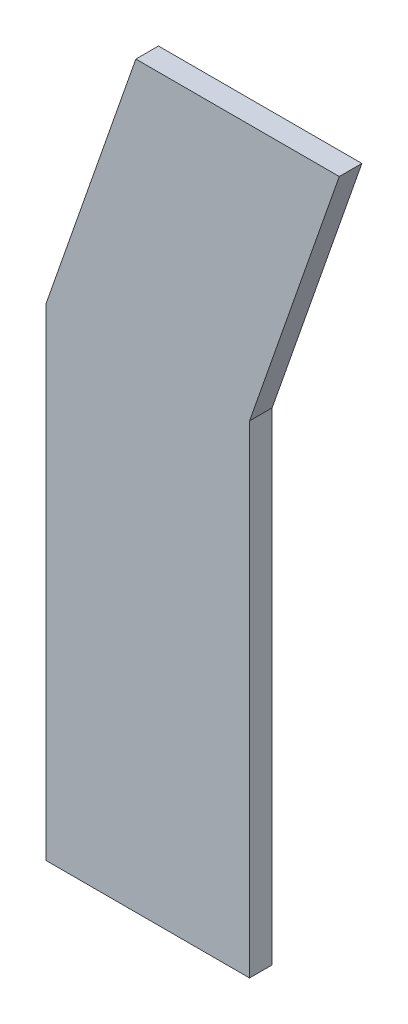
ISO-10303-21;
HEADER;
FILE_DESCRIPTION(('STEP AP214'),'2;1');
FILE_NAME('part.step','',(''),(''),'','','');
FILE_SCHEMA(('AUTOMOTIVE_DESIGN { 1 0 10303 214 1 1 1 1 }'));
ENDSEC;
DATA;
#1=APPLICATION_CONTEXT('core data for automotive mechanical design processes');
#2=APPLICATION_PROTOCOL_DEFINITION('international standard','automotive_design',2000,#1);
#3=PRODUCT_CONTEXT('',#1,'mechanical');
#4=PRODUCT('Part','Part','',(#3));
#5=PRODUCT_RELATED_PRODUCT_CATEGORY('part','',(#4));
#6=PRODUCT_DEFINITION_FORMATION('','',#4);
#7=PRODUCT_DEFINITION_CONTEXT('part definition',#1,'design');
#8=PRODUCT_DEFINITION('design','',#6,#7);
#9=PRODUCT_DEFINITION_SHAPE('','',#8);
#10=(LENGTH_UNIT() NAMED_UNIT(*) SI_UNIT(.MILLI.,.METRE.));
#11=(NAMED_UNIT(*) PLANE_ANGLE_UNIT() SI_UNIT($,.RADIAN.));
#12=(NAMED_UNIT(*) SI_UNIT($,.STERADIAN.) SOLID_ANGLE_UNIT());
#13=UNCERTAINTY_MEASURE_WITH_UNIT(LENGTH_MEASURE(1.E-05),#10,'distance_accuracy_value','');
#14=(GEOMETRIC_REPRESENTATION_CONTEXT(3) GLOBAL_UNCERTAINTY_ASSIGNED_CONTEXT((#13)) GLOBAL_UNIT_ASSIGNED_CONTEXT((#10,
#11,#12)) REPRESENTATION_CONTEXT('',''));
#15=CARTESIAN_POINT('',(0.,0.,0.));
#16=DIRECTION('',(0.,0.,1.));
#17=DIRECTION('',(1.,0.,0.));
#18=AXIS2_PLACEMENT_3D('',#15,#16,#17);
#19=CARTESIAN_POINT('',(180.,0.,20.));
#20=DIRECTION('',(-0.943916265368809,0.330184923902047,0.));
#21=DIRECTION('',(-0.330184923902047,-0.943916265368809,0.));
#22=AXIS2_PLACEMENT_3D('',#19,#20,#21);
#23=PLANE('',#22);
#24=DIRECTION('',(0.330184923902047,0.943916265368809,0.));
#25=VECTOR('',#24,1.);
#26=CARTESIAN_POINT('',(180.,0.,0.));
#27=LINE('',#26,#25);
#28=CARTESIAN_POINT('',(180.,0.,0.));
#29=VERTEX_POINT('',#28);
#30=CARTESIAN_POINT('',(259.398855032768,226.981504277655,0.));
#31=VERTEX_POINT('',#30);
#32=EDGE_CURVE('E134',#29,#31,#27,.T.);
#33=ORIENTED_EDGE('',*,*,#32,.T.);
#34=DIRECTION('',(0.,0.,-1.));
#35=VECTOR('',#34,1.);
#36=CARTESIAN_POINT('',(259.398855032768,226.981504277655,20.));
#37=LINE('',#36,#35);
#38=CARTESIAN_POINT('',(259.398855032768,226.981504277655,20.));
#39=VERTEX_POINT('',#38);
#40=EDGE_CURVE('E11',#39,#31,#37,.T.);
#41=ORIENTED_EDGE('',*,*,#40,.F.);
#42=DIRECTION('',(0.330184923902047,0.943916265368809,0.));
#43=VECTOR('',#42,1.);
#44=CARTESIAN_POINT('',(180.,0.,20.));
#45=LINE('',#44,#43);
#46=CARTESIAN_POINT('',(180.,0.,20.));
#47=VERTEX_POINT('',#46);
#48=EDGE_CURVE('E150',#47,#39,#45,.T.);
#49=ORIENTED_EDGE('',*,*,#48,.F.);
#50=DIRECTION('',(0.,0.,-1.));
#51=VECTOR('',#50,1.);
#52=CARTESIAN_POINT('',(180.,0.,20.));
#53=LINE('',#52,#51);
#54=EDGE_CURVE('E130',#47,#29,#53,.T.);
#55=ORIENTED_EDGE('',*,*,#54,.T.);
#56=EDGE_LOOP('',(#33,#41,#49,#55));
#57=FACE_BOUND('',#56,.T.);
#58=ADVANCED_FACE('F45',(#57),#23,.F.);
#59=CARTESIAN_POINT('',(259.398855032768,226.981504277655,20.));
#60=DIRECTION('',(0.,-1.,0.));
#61=DIRECTION('',(1.,0.,0.));
#62=AXIS2_PLACEMENT_3D('',#59,#60,#61);
#63=PLANE('',#62);
#64=DIRECTION('',(-1.,0.,0.));
#65=VECTOR('',#64,1.);
#66=CARTESIAN_POINT('',(259.398855032768,226.981504277655,0.));
#67=LINE('',#66,#65);
#68=CARTESIAN_POINT('',(79.398855032768,226.981504277655,0.));
#69=VERTEX_POINT('',#68);
#70=EDGE_CURVE('E138',#31,#69,#67,.T.);
#71=ORIENTED_EDGE('',*,*,#70,.T.);
#72=DIRECTION('',(0.,0.,-1.));
#73=VECTOR('',#72,1.);
#74=CARTESIAN_POINT('',(79.398855032768,226.981504277655,20.));
#75=LINE('',#74,#73);
#76=CARTESIAN_POINT('',(79.398855032768,226.981504277655,20.));
#77=VERTEX_POINT('',#76);
#78=EDGE_CURVE('E54',#77,#69,#75,.T.);
#79=ORIENTED_EDGE('',*,*,#78,.F.);
#80=DIRECTION('',(-1.,0.,0.));
#81=VECTOR('',#80,1.);
#82=CARTESIAN_POINT('',(259.398855032768,226.981504277655,20.));
#83=LINE('',#82,#81);
#84=EDGE_CURVE('E99',#39,#77,#83,.T.);
#85=ORIENTED_EDGE('',*,*,#84,.F.);
#86=ORIENTED_EDGE('',*,*,#40,.T.);
#87=EDGE_LOOP('',(#71,#79,#85,#86));
#88=FACE_BOUND('',#87,.T.);
#89=ADVANCED_FACE('F178',(#88),#63,.F.);
#90=CARTESIAN_POINT('',(0.,0.,20.));
#91=DIRECTION('',(0.943916265368809,-0.330184923902047,0.));
#92=DIRECTION('',(0.330184923902047,0.943916265368809,0.));
#93=AXIS2_PLACEMENT_3D('',#90,#91,#92);
#94=PLANE('',#93);
#95=DIRECTION('',(-0.330184923902047,-0.943916265368809,0.));
#96=VECTOR('',#95,1.);
#97=CARTESIAN_POINT('',(0.,0.,0.));
#98=LINE('',#97,#96);
#99=CARTESIAN_POINT('',(0.,0.,0.));
#100=VERTEX_POINT('',#99);
#101=EDGE_CURVE('E141',#69,#100,#98,.T.);
#102=ORIENTED_EDGE('',*,*,#101,.T.);
#103=DIRECTION('',(0.,0.,-1.));
#104=VECTOR('',#103,1.);
#105=CARTESIAN_POINT('',(0.,0.,20.));
#106=LINE('',#105,#104);
#107=CARTESIAN_POINT('',(0.,0.,20.));
#108=VERTEX_POINT('',#107);
#109=EDGE_CURVE('E123',#108,#100,#106,.T.);
#110=ORIENTED_EDGE('',*,*,#109,.F.);
#111=DIRECTION('',(-0.330184923902047,-0.943916265368809,0.));
#112=VECTOR('',#111,1.);
#113=CARTESIAN_POINT('',(0.,0.,20.));
#114=LINE('',#113,#112);
#115=EDGE_CURVE('E112',#77,#108,#114,.T.);
#116=ORIENTED_EDGE('',*,*,#115,.F.);
#117=ORIENTED_EDGE('',*,*,#78,.T.);
#118=EDGE_LOOP('',(#102,#110,#116,#117));
#119=FACE_BOUND('',#118,.T.);
#120=ADVANCED_FACE('F160',(#119),#94,.F.);
#121=CARTESIAN_POINT('',(0.,0.,20.));
#122=DIRECTION('',(1.,0.,0.));
#123=DIRECTION('',(0.,1.,0.));
#124=AXIS2_PLACEMENT_3D('',#121,#122,#123);
#125=PLANE('',#124);
#126=DIRECTION('',(0.,-1.,0.));
#127=VECTOR('',#126,1.);
#128=CARTESIAN_POINT('',(0.,0.,0.));
#129=LINE('',#128,#127);
#130=CARTESIAN_POINT('',(0.,-426.89,0.));
#131=VERTEX_POINT('',#130);
#132=EDGE_CURVE('E121',#100,#131,#129,.T.);
#133=ORIENTED_EDGE('',*,*,#132,.T.);
#134=DIRECTION('',(0.,0.,-1.));
#135=VECTOR('',#134,1.);
#136=CARTESIAN_POINT('',(0.,-426.89,20.));
#137=LINE('',#136,#135);
#138=CARTESIAN_POINT('',(0.,-426.89,20.));
#139=VERTEX_POINT('',#138);
#140=EDGE_CURVE('E118',#139,#131,#137,.T.);
#141=ORIENTED_EDGE('',*,*,#140,.F.);
#142=DIRECTION('',(0.,-1.,0.));
#143=VECTOR('',#142,1.);
#144=CARTESIAN_POINT('',(0.,0.,20.));
#145=LINE('',#144,#143);
#146=EDGE_CURVE('E106',#108,#139,#145,.T.);
#147=ORIENTED_EDGE('',*,*,#146,.F.);
#148=ORIENTED_EDGE('',*,*,#109,.T.);
#149=EDGE_LOOP('',(#133,#141,#147,#148));
#150=FACE_BOUND('',#149,.T.);
#151=ADVANCED_FACE('F119',(#150),#125,.F.);
#152=CARTESIAN_POINT('',(0.,-426.89,20.));
#153=DIRECTION('',(0.,1.,0.));
#154=DIRECTION('',(0.,0.,1.));
#155=AXIS2_PLACEMENT_3D('',#152,#153,#154);
#156=PLANE('',#155);
#157=DIRECTION('',(1.,0.,0.));
#158=VECTOR('',#157,1.);
#159=CARTESIAN_POINT('',(0.,-426.89,0.));
#160=LINE('',#159,#158);
#161=CARTESIAN_POINT('',(180.,-426.89,0.));
#162=VERTEX_POINT('',#161);
#163=EDGE_CURVE('E85',#131,#162,#160,.T.);
#164=ORIENTED_EDGE('',*,*,#163,.T.);
#165=DIRECTION('',(0.,0.,-1.));
#166=VECTOR('',#165,1.);
#167=CARTESIAN_POINT('',(180.,-426.89,20.));
#168=LINE('',#167,#166);
#169=CARTESIAN_POINT('',(180.,-426.89,20.));
#170=VERTEX_POINT('',#169);
#171=EDGE_CURVE('E124',#170,#162,#168,.T.);
#172=ORIENTED_EDGE('',*,*,#171,.F.);
#173=DIRECTION('',(1.,0.,0.));
#174=VECTOR('',#173,1.);
#175=CARTESIAN_POINT('',(0.,-426.89,20.));
#176=LINE('',#175,#174);
#177=EDGE_CURVE('E110',#139,#170,#176,.T.);
#178=ORIENTED_EDGE('',*,*,#177,.F.);
#179=ORIENTED_EDGE('',*,*,#140,.T.);
#180=EDGE_LOOP('',(#164,#172,#178,#179));
#181=FACE_BOUND('',#180,.T.);
#182=ADVANCED_FACE('F126',(#181),#156,.F.);
#183=CARTESIAN_POINT('',(180.,-426.89,20.));
#184=DIRECTION('',(-1.,0.,0.));
#185=DIRECTION('',(0.,0.,1.));
#186=AXIS2_PLACEMENT_3D('',#183,#184,#185);
#187=PLANE('',#186);
#188=DIRECTION('',(0.,1.,0.));
#189=VECTOR('',#188,1.);
#190=CARTESIAN_POINT('',(180.,-426.89,0.));
#191=LINE('',#190,#189);
#192=EDGE_CURVE('E91',#162,#29,#191,.T.);
#193=ORIENTED_EDGE('',*,*,#192,.T.);
#194=ORIENTED_EDGE('',*,*,#54,.F.);
#195=DIRECTION('',(0.,1.,0.));
#196=VECTOR('',#195,1.);
#197=CARTESIAN_POINT('',(180.,-426.89,20.));
#198=LINE('',#197,#196);
#199=EDGE_CURVE('E62',#170,#47,#198,.T.);
#200=ORIENTED_EDGE('',*,*,#199,.F.);
#201=ORIENTED_EDGE('',*,*,#171,.T.);
#202=EDGE_LOOP('',(#193,#194,#200,#201));
#203=FACE_BOUND('',#202,.T.);
#204=ADVANCED_FACE('F167',(#203),#187,.F.);
#205=CARTESIAN_POINT('',(0.,0.,20.));
#206=DIRECTION('',(0.,0.,1.));
#207=DIRECTION('',(1.,0.,0.));
#208=AXIS2_PLACEMENT_3D('',#205,#206,#207);
#209=PLANE('',#208);
#210=ORIENTED_EDGE('',*,*,#48,.T.);
#211=ORIENTED_EDGE('',*,*,#84,.T.);
#212=ORIENTED_EDGE('',*,*,#115,.T.);
#213=ORIENTED_EDGE('',*,*,#146,.T.);
#214=ORIENTED_EDGE('',*,*,#177,.T.);
#215=ORIENTED_EDGE('',*,*,#199,.T.);
#216=EDGE_LOOP('',(#210,#211,#212,#213,#214,#215));
#217=FACE_BOUND('',#216,.T.);
#218=ADVANCED_FACE('F108',(#217),#209,.T.);
#219=CARTESIAN_POINT('',(0.,0.,0.));
#220=DIRECTION('',(0.,0.,1.));
#221=DIRECTION('',(1.,0.,0.));
#222=AXIS2_PLACEMENT_3D('',#219,#220,#221);
#223=PLANE('',#222);
#224=ORIENTED_EDGE('',*,*,#32,.F.);
#225=ORIENTED_EDGE('',*,*,#192,.F.);
#226=ORIENTED_EDGE('',*,*,#163,.F.);
#227=ORIENTED_EDGE('',*,*,#132,.F.);
#228=ORIENTED_EDGE('',*,*,#101,.F.);
#229=ORIENTED_EDGE('',*,*,#70,.F.);
#230=EDGE_LOOP('',(#224,#225,#226,#227,#228,#229));
#231=FACE_BOUND('',#230,.T.);
#232=ADVANCED_FACE('F163',(#231),#223,.F.);
#233=CLOSED_SHELL('',(#58,#89,#120,#151,#182,#204,#218,#232));
#234=MANIFOLD_SOLID_BREP('B2',#233);
#235=ADVANCED_BREP_SHAPE_REPRESENTATION('',(#18,#234),#14);
#236=SHAPE_DEFINITION_REPRESENTATION(#9,#235);
ENDSEC;
END-ISO-10303-21;
